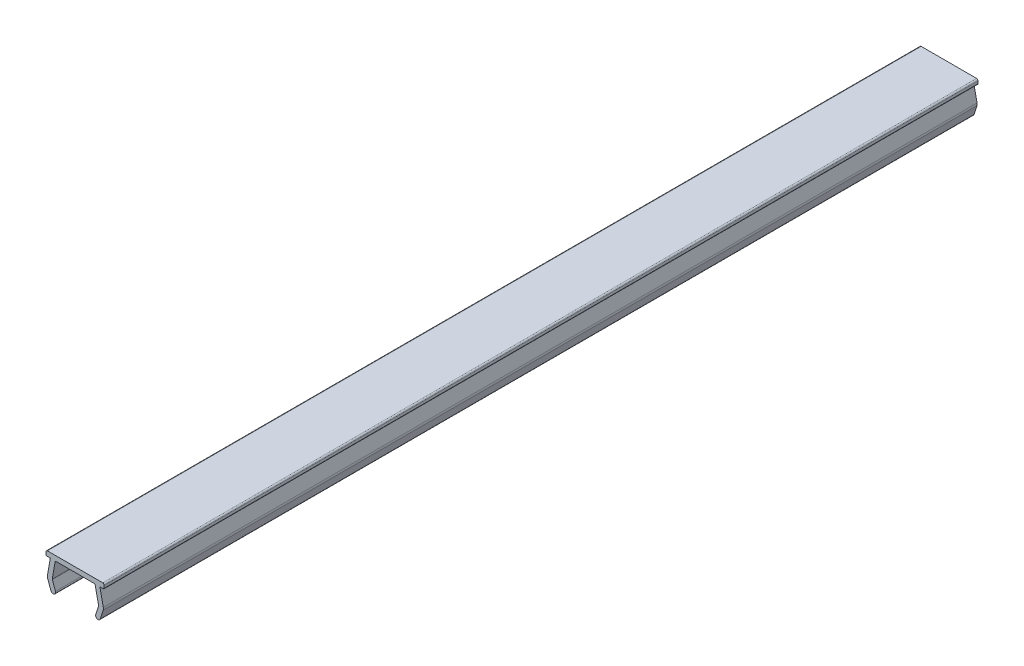
ISO-10303-21;
HEADER;
FILE_DESCRIPTION(('STEP AP214'),'2;1');
FILE_NAME('part.step','',(''),(''),'','','');
FILE_SCHEMA(('AUTOMOTIVE_DESIGN { 1 0 10303 214 1 1 1 1 }'));
ENDSEC;
DATA;
#1=APPLICATION_CONTEXT('core data for automotive mechanical design processes');
#2=APPLICATION_PROTOCOL_DEFINITION('international standard','automotive_design',2000,#1);
#3=PRODUCT_CONTEXT('',#1,'mechanical');
#4=PRODUCT('Part','Part','',(#3));
#5=PRODUCT_RELATED_PRODUCT_CATEGORY('part','',(#4));
#6=PRODUCT_DEFINITION_FORMATION('','',#4);
#7=PRODUCT_DEFINITION_CONTEXT('part definition',#1,'design');
#8=PRODUCT_DEFINITION('design','',#6,#7);
#9=PRODUCT_DEFINITION_SHAPE('','',#8);
#10=(LENGTH_UNIT() NAMED_UNIT(*) SI_UNIT(.MILLI.,.METRE.));
#11=(NAMED_UNIT(*) PLANE_ANGLE_UNIT() SI_UNIT($,.RADIAN.));
#12=(NAMED_UNIT(*) SI_UNIT($,.STERADIAN.) SOLID_ANGLE_UNIT());
#13=UNCERTAINTY_MEASURE_WITH_UNIT(LENGTH_MEASURE(1.E-05),#10,'distance_accuracy_value','');
#14=(GEOMETRIC_REPRESENTATION_CONTEXT(3) GLOBAL_UNCERTAINTY_ASSIGNED_CONTEXT((#13)) GLOBAL_UNIT_ASSIGNED_CONTEXT((#10,
#11,#12)) REPRESENTATION_CONTEXT('',''));
#15=CARTESIAN_POINT('',(0.,0.,0.));
#16=DIRECTION('',(0.,0.,1.));
#17=DIRECTION('',(1.,0.,0.));
#18=AXIS2_PLACEMENT_3D('',#15,#16,#17);
#19=CARTESIAN_POINT('',(10.8350640940869,93.7566345859164,180.));
#20=DIRECTION('',(0.,0.,-1.));
#21=DIRECTION('',(-1.,0.,0.));
#22=AXIS2_PLACEMENT_3D('',#19,#20,#21);
#23=CYLINDRICAL_SURFACE('',#22,0.999999999999551);
#24=CARTESIAN_POINT('',(10.8350640940869,93.7566345859164,0.));
#25=DIRECTION('',(0.,0.,1.));
#26=DIRECTION('',(1.,0.,0.));
#27=AXIS2_PLACEMENT_3D('',#24,#25,#26);
#28=CIRCLE('',#27,0.999999999999551);
#29=CARTESIAN_POINT('',(11.7860981628175,93.4475485135794,0.));
#30=VERTEX_POINT('',#29);
#31=CARTESIAN_POINT('',(11.8132267936406,93.964475229682,0.));
#32=VERTEX_POINT('',#31);
#33=EDGE_CURVE('E240',#30,#32,#28,.T.);
#34=ORIENTED_EDGE('',*,*,#33,.T.);
#35=DIRECTION('',(0.,0.,-1.));
#36=VECTOR('',#35,1.);
#37=CARTESIAN_POINT('',(11.8132267936406,93.964475229682,180.));
#38=LINE('',#37,#36);
#39=CARTESIAN_POINT('',(11.8132267936406,93.964475229682,180.));
#40=VERTEX_POINT('',#39);
#41=EDGE_CURVE('E11',#40,#32,#38,.T.);
#42=ORIENTED_EDGE('',*,*,#41,.F.);
#43=CARTESIAN_POINT('',(10.8350640940869,93.7566345859164,180.));
#44=DIRECTION('',(0.,0.,1.));
#45=DIRECTION('',(1.,0.,0.));
#46=AXIS2_PLACEMENT_3D('',#43,#44,#45);
#47=CIRCLE('',#46,0.999999999999551);
#48=CARTESIAN_POINT('',(11.7860981628175,93.4475485135794,180.));
#49=VERTEX_POINT('',#48);
#50=EDGE_CURVE('E290',#49,#40,#47,.T.);
#51=ORIENTED_EDGE('',*,*,#50,.F.);
#52=DIRECTION('',(0.,0.,-1.));
#53=VECTOR('',#52,1.);
#54=CARTESIAN_POINT('',(11.7860981628175,93.4475485135794,180.));
#55=LINE('',#54,#53);
#56=EDGE_CURVE('E236',#49,#30,#55,.T.);
#57=ORIENTED_EDGE('',*,*,#56,.T.);
#58=EDGE_LOOP('',(#34,#42,#51,#57));
#59=FACE_BOUND('',#58,.T.);
#60=ADVANCED_FACE('F36',(#59),#23,.T.);
#61=CARTESIAN_POINT('',(11.1069619444081,97.2883772298451,180.));
#62=DIRECTION('',(-0.978162699554305,-0.207840643764964,0.));
#63=DIRECTION('',(0.207840643764964,-0.978162699554305,0.));
#64=AXIS2_PLACEMENT_3D('',#61,#62,#63);
#65=PLANE('',#64);
#66=DIRECTION('',(-0.207840643764965,0.978162699554305,0.));
#67=VECTOR('',#66,1.);
#68=CARTESIAN_POINT('',(11.1069619444081,97.2883772298451,0.));
#69=LINE('',#68,#67);
#70=CARTESIAN_POINT('',(11.1069619444081,97.2883772298451,0.));
#71=VERTEX_POINT('',#70);
#72=EDGE_CURVE('E243',#32,#71,#69,.T.);
#73=ORIENTED_EDGE('',*,*,#72,.T.);
#74=DIRECTION('',(0.,0.,-1.));
#75=VECTOR('',#74,1.);
#76=CARTESIAN_POINT('',(11.1069619444081,97.2883772298451,180.));
#77=LINE('',#76,#75);
#78=CARTESIAN_POINT('',(11.1069619444081,97.2883772298451,180.));
#79=VERTEX_POINT('',#78);
#80=EDGE_CURVE('E44',#79,#71,#77,.T.);
#81=ORIENTED_EDGE('',*,*,#80,.F.);
#82=DIRECTION('',(-0.207840643764965,0.978162699554305,0.));
#83=VECTOR('',#82,1.);
#84=CARTESIAN_POINT('',(11.1069619444081,97.2883772298451,180.));
#85=LINE('',#84,#83);
#86=EDGE_CURVE('E149',#40,#79,#85,.T.);
#87=ORIENTED_EDGE('',*,*,#86,.F.);
#88=ORIENTED_EDGE('',*,*,#41,.T.);
#89=EDGE_LOOP('',(#73,#81,#87,#88));
#90=FACE_BOUND('',#89,.T.);
#91=ADVANCED_FACE('F438',(#90),#65,.F.);
#92=CARTESIAN_POINT('',(11.8000026893795,97.2883772298451,180.));
#93=DIRECTION('',(0.,1.,0.));
#94=DIRECTION('',(0.,0.,1.));
#95=AXIS2_PLACEMENT_3D('',#92,#93,#94);
#96=PLANE('',#95);
#97=DIRECTION('',(1.,0.,0.));
#98=VECTOR('',#97,1.);
#99=CARTESIAN_POINT('',(11.8000026893795,97.2883772298451,0.));
#100=LINE('',#99,#98);
#101=CARTESIAN_POINT('',(11.8000026893795,97.2883772298452,0.));
#102=VERTEX_POINT('',#101);
#103=EDGE_CURVE('E245',#71,#102,#100,.T.);
#104=ORIENTED_EDGE('',*,*,#103,.T.);
#105=DIRECTION('',(0.,0.,-1.));
#106=VECTOR('',#105,1.);
#107=CARTESIAN_POINT('',(11.8000026893795,97.2883772298452,180.));
#108=LINE('',#107,#106);
#109=CARTESIAN_POINT('',(11.8000026893795,97.2883772298452,180.));
#110=VERTEX_POINT('',#109);
#111=EDGE_CURVE('E351',#110,#102,#108,.T.);
#112=ORIENTED_EDGE('',*,*,#111,.F.);
#113=DIRECTION('',(1.,0.,0.));
#114=VECTOR('',#113,1.);
#115=CARTESIAN_POINT('',(11.8000026893795,97.2883772298451,180.));
#116=LINE('',#115,#114);
#117=EDGE_CURVE('E359',#79,#110,#116,.T.);
#118=ORIENTED_EDGE('',*,*,#117,.F.);
#119=ORIENTED_EDGE('',*,*,#80,.T.);
#120=EDGE_LOOP('',(#104,#112,#118,#119));
#121=FACE_BOUND('',#120,.T.);
#122=ADVANCED_FACE('F357',(#121),#96,.F.);
#123=CARTESIAN_POINT('',(11.8000026893795,97.4883772298454,180.));
#124=DIRECTION('',(0.,0.,-1.));
#125=DIRECTION('',(-1.,0.,0.));
#126=AXIS2_PLACEMENT_3D('',#123,#124,#125);
#127=CYLINDRICAL_SURFACE('',#126,0.200000000000197);
#128=CARTESIAN_POINT('',(11.8000026893795,97.4883772298454,0.));
#129=DIRECTION('',(0.,0.,1.));
#130=DIRECTION('',(1.,0.,0.));
#131=AXIS2_PLACEMENT_3D('',#128,#129,#130);
#132=CIRCLE('',#131,0.200000000000197);
#133=CARTESIAN_POINT('',(12.0000026893795,97.4883772298454,0.));
#134=VERTEX_POINT('',#133);
#135=EDGE_CURVE('E247',#102,#134,#132,.T.);
#136=ORIENTED_EDGE('',*,*,#135,.T.);
#137=DIRECTION('',(0.,0.,-1.));
#138=VECTOR('',#137,1.);
#139=CARTESIAN_POINT('',(12.0000026893795,97.4883772298454,180.));
#140=LINE('',#139,#138);
#141=CARTESIAN_POINT('',(12.0000026893795,97.4883772298454,180.));
#142=VERTEX_POINT('',#141);
#143=EDGE_CURVE('E348',#142,#134,#140,.T.);
#144=ORIENTED_EDGE('',*,*,#143,.F.);
#145=CARTESIAN_POINT('',(11.8000026893795,97.4883772298454,180.));
#146=DIRECTION('',(0.,0.,1.));
#147=DIRECTION('',(1.,0.,0.));
#148=AXIS2_PLACEMENT_3D('',#145,#146,#147);
#149=CIRCLE('',#148,0.200000000000197);
#150=EDGE_CURVE('E377',#110,#142,#149,.T.);
#151=ORIENTED_EDGE('',*,*,#150,.F.);
#152=ORIENTED_EDGE('',*,*,#111,.T.);
#153=EDGE_LOOP('',(#136,#144,#151,#152));
#154=FACE_BOUND('',#153,.T.);
#155=ADVANCED_FACE('F368',(#154),#127,.T.);
#156=CARTESIAN_POINT('',(12.0000026893795,97.9883772298435,180.));
#157=DIRECTION('',(-1.,0.,0.));
#158=DIRECTION('',(0.,0.,1.));
#159=AXIS2_PLACEMENT_3D('',#156,#157,#158);
#160=PLANE('',#159);
#161=DIRECTION('',(0.,1.,0.));
#162=VECTOR('',#161,1.);
#163=CARTESIAN_POINT('',(12.0000026893795,97.9883772298435,0.));
#164=LINE('',#163,#162);
#165=CARTESIAN_POINT('',(12.0000026893798,97.9883772298435,0.));
#166=VERTEX_POINT('',#165);
#167=EDGE_CURVE('E249',#134,#166,#164,.T.);
#168=ORIENTED_EDGE('',*,*,#167,.T.);
#169=DIRECTION('',(0.,0.,-1.));
#170=VECTOR('',#169,1.);
#171=CARTESIAN_POINT('',(12.0000026893798,97.9883772298435,180.));
#172=LINE('',#171,#170);
#173=CARTESIAN_POINT('',(12.0000026893798,97.9883772298435,180.));
#174=VERTEX_POINT('',#173);
#175=EDGE_CURVE('E345',#174,#166,#172,.T.);
#176=ORIENTED_EDGE('',*,*,#175,.F.);
#177=DIRECTION('',(0.,1.,0.));
#178=VECTOR('',#177,1.);
#179=CARTESIAN_POINT('',(12.0000026893795,97.9883772298435,180.));
#180=LINE('',#179,#178);
#181=EDGE_CURVE('E374',#142,#174,#180,.T.);
#182=ORIENTED_EDGE('',*,*,#181,.F.);
#183=ORIENTED_EDGE('',*,*,#143,.T.);
#184=EDGE_LOOP('',(#168,#176,#182,#183));
#185=FACE_BOUND('',#184,.T.);
#186=ADVANCED_FACE('F372',(#185),#160,.F.);
#187=CARTESIAN_POINT('',(11.7000026893802,97.9883772298435,180.));
#188=DIRECTION('',(0.,0.,-1.));
#189=DIRECTION('',(-1.,0.,0.));
#190=AXIS2_PLACEMENT_3D('',#187,#188,#189);
#191=CYLINDRICAL_SURFACE('',#190,0.299999999999631);
#192=CARTESIAN_POINT('',(11.7000026893802,97.9883772298435,0.));
#193=DIRECTION('',(0.,0.,1.));
#194=DIRECTION('',(1.,0.,0.));
#195=AXIS2_PLACEMENT_3D('',#192,#193,#194);
#196=CIRCLE('',#195,0.299999999999631);
#197=CARTESIAN_POINT('',(11.7000026893802,98.2883772298435,0.));
#198=VERTEX_POINT('',#197);
#199=EDGE_CURVE('E251',#166,#198,#196,.T.);
#200=ORIENTED_EDGE('',*,*,#199,.T.);
#201=DIRECTION('',(0.,0.,-1.));
#202=VECTOR('',#201,1.);
#203=CARTESIAN_POINT('',(11.7000026893802,98.2883772298435,180.));
#204=LINE('',#203,#202);
#205=CARTESIAN_POINT('',(11.7000026893802,98.2883772298435,180.));
#206=VERTEX_POINT('',#205);
#207=EDGE_CURVE('E342',#206,#198,#204,.T.);
#208=ORIENTED_EDGE('',*,*,#207,.F.);
#209=CARTESIAN_POINT('',(11.7000026893802,97.9883772298435,180.));
#210=DIRECTION('',(0.,0.,1.));
#211=DIRECTION('',(1.,0.,0.));
#212=AXIS2_PLACEMENT_3D('',#209,#210,#211);
#213=CIRCLE('',#212,0.299999999999631);
#214=EDGE_CURVE('E376',#174,#206,#213,.T.);
#215=ORIENTED_EDGE('',*,*,#214,.F.);
#216=ORIENTED_EDGE('',*,*,#175,.T.);
#217=EDGE_LOOP('',(#200,#208,#215,#216));
#218=FACE_BOUND('',#217,.T.);
#219=ADVANCED_FACE('F451',(#218),#191,.T.);
#220=CARTESIAN_POINT('',(0.300002689378744,98.2883772298428,180.));
#221=DIRECTION('',(0.,-1.,0.));
#222=DIRECTION('',(1.,0.,0.));
#223=AXIS2_PLACEMENT_3D('',#220,#221,#222);
#224=PLANE('',#223);
#225=DIRECTION('',(-1.,0.,0.));
#226=VECTOR('',#225,1.);
#227=CARTESIAN_POINT('',(0.300002689378744,98.2883772298428,0.));
#228=LINE('',#227,#226);
#229=CARTESIAN_POINT('',(0.300002689378744,98.2883772298432,0.));
#230=VERTEX_POINT('',#229);
#231=EDGE_CURVE('E253',#198,#230,#228,.T.);
#232=ORIENTED_EDGE('',*,*,#231,.T.);
#233=DIRECTION('',(0.,0.,-1.));
#234=VECTOR('',#233,1.);
#235=CARTESIAN_POINT('',(0.300002689378744,98.2883772298432,180.));
#236=LINE('',#235,#234);
#237=CARTESIAN_POINT('',(0.300002689378744,98.2883772298432,180.));
#238=VERTEX_POINT('',#237);
#239=EDGE_CURVE('E339',#238,#230,#236,.T.);
#240=ORIENTED_EDGE('',*,*,#239,.F.);
#241=DIRECTION('',(-1.,0.,0.));
#242=VECTOR('',#241,1.);
#243=CARTESIAN_POINT('',(0.300002689378744,98.2883772298428,180.));
#244=LINE('',#243,#242);
#245=EDGE_CURVE('E379',#206,#238,#244,.T.);
#246=ORIENTED_EDGE('',*,*,#245,.F.);
#247=ORIENTED_EDGE('',*,*,#207,.T.);
#248=EDGE_LOOP('',(#232,#240,#246,#247));
#249=FACE_BOUND('',#248,.T.);
#250=ADVANCED_FACE('F454',(#249),#224,.F.);
#251=CARTESIAN_POINT('',(0.300002689378744,97.9883772298435,180.));
#252=DIRECTION('',(0.,0.,-1.));
#253=DIRECTION('',(-1.,0.,0.));
#254=AXIS2_PLACEMENT_3D('',#251,#252,#253);
#255=CYLINDRICAL_SURFACE('',#254,0.299999999999643);
#256=CARTESIAN_POINT('',(0.300002689378744,97.9883772298435,0.));
#257=DIRECTION('',(0.,0.,1.));
#258=DIRECTION('',(1.,0.,0.));
#259=AXIS2_PLACEMENT_3D('',#256,#257,#258);
#260=CIRCLE('',#259,0.299999999999643);
#261=CARTESIAN_POINT('',(2.6893787435367E-06,97.9883772298435,0.));
#262=VERTEX_POINT('',#261);
#263=EDGE_CURVE('E255',#230,#262,#260,.T.);
#264=ORIENTED_EDGE('',*,*,#263,.T.);
#265=DIRECTION('',(0.,0.,-1.));
#266=VECTOR('',#265,1.);
#267=CARTESIAN_POINT('',(2.6893787435367E-06,97.9883772298435,180.));
#268=LINE('',#267,#266);
#269=CARTESIAN_POINT('',(2.6893787435367E-06,97.9883772298435,180.));
#270=VERTEX_POINT('',#269);
#271=EDGE_CURVE('E336',#270,#262,#268,.T.);
#272=ORIENTED_EDGE('',*,*,#271,.F.);
#273=CARTESIAN_POINT('',(0.300002689378744,97.9883772298435,180.));
#274=DIRECTION('',(0.,0.,1.));
#275=DIRECTION('',(1.,0.,0.));
#276=AXIS2_PLACEMENT_3D('',#273,#274,#275);
#277=CIRCLE('',#276,0.299999999999643);
#278=EDGE_CURVE('E385',#238,#270,#277,.T.);
#279=ORIENTED_EDGE('',*,*,#278,.F.);
#280=ORIENTED_EDGE('',*,*,#239,.T.);
#281=EDGE_LOOP('',(#264,#272,#279,#280));
#282=FACE_BOUND('',#281,.T.);
#283=ADVANCED_FACE('F458',(#282),#255,.T.);
#284=CARTESIAN_POINT('',(2.6893794711E-06,97.4883772298436,180.));
#285=DIRECTION('',(1.,1.45512660699133E-12,0.));
#286=DIRECTION('',(-1.45512660699133E-12,1.,0.));
#287=AXIS2_PLACEMENT_3D('',#284,#285,#286);
#288=PLANE('',#287);
#289=DIRECTION('',(1.45512660699133E-12,-1.,0.));
#290=VECTOR('',#289,1.);
#291=CARTESIAN_POINT('',(2.6893794711E-06,97.4883772298436,0.));
#292=LINE('',#291,#290);
#293=CARTESIAN_POINT('',(2.68937983897142E-06,97.4883772298436,0.));
#294=VERTEX_POINT('',#293);
#295=EDGE_CURVE('E257',#262,#294,#292,.T.);
#296=ORIENTED_EDGE('',*,*,#295,.T.);
#297=DIRECTION('',(0.,0.,-1.));
#298=VECTOR('',#297,1.);
#299=CARTESIAN_POINT('',(2.68937983897142E-06,97.4883772298436,180.));
#300=LINE('',#299,#298);
#301=CARTESIAN_POINT('',(2.68937983897142E-06,97.4883772298436,180.));
#302=VERTEX_POINT('',#301);
#303=EDGE_CURVE('E333',#302,#294,#300,.T.);
#304=ORIENTED_EDGE('',*,*,#303,.F.);
#305=DIRECTION('',(1.45512660699133E-12,-1.,0.));
#306=VECTOR('',#305,1.);
#307=CARTESIAN_POINT('',(2.6893794711E-06,97.4883772298436,180.));
#308=LINE('',#307,#306);
#309=EDGE_CURVE('E387',#270,#302,#308,.T.);
#310=ORIENTED_EDGE('',*,*,#309,.F.);
#311=ORIENTED_EDGE('',*,*,#271,.T.);
#312=EDGE_LOOP('',(#296,#304,#310,#311));
#313=FACE_BOUND('',#312,.T.);
#314=ADVANCED_FACE('F462',(#313),#288,.F.);
#315=CARTESIAN_POINT('',(0.200002689380199,97.4883772298436,180.));
#316=DIRECTION('',(0.,0.,-1.));
#317=DIRECTION('',(-1.,0.,0.));
#318=AXIS2_PLACEMENT_3D('',#315,#316,#317);
#319=CYLINDRICAL_SURFACE('',#318,0.20000000000036);
#320=CARTESIAN_POINT('',(0.200002689380199,97.4883772298436,0.));
#321=DIRECTION('',(0.,0.,1.));
#322=DIRECTION('',(1.,0.,0.));
#323=AXIS2_PLACEMENT_3D('',#320,#321,#322);
#324=CIRCLE('',#323,0.20000000000036);
#325=CARTESIAN_POINT('',(0.200002689380199,97.2883772298436,0.));
#326=VERTEX_POINT('',#325);
#327=EDGE_CURVE('E259',#294,#326,#324,.T.);
#328=ORIENTED_EDGE('',*,*,#327,.T.);
#329=DIRECTION('',(0.,0.,-1.));
#330=VECTOR('',#329,1.);
#331=CARTESIAN_POINT('',(0.200002689380199,97.2883772298436,180.));
#332=LINE('',#331,#330);
#333=CARTESIAN_POINT('',(0.200002689380199,97.2883772298436,180.));
#334=VERTEX_POINT('',#333);
#335=EDGE_CURVE('E330',#334,#326,#332,.T.);
#336=ORIENTED_EDGE('',*,*,#335,.F.);
#337=CARTESIAN_POINT('',(0.200002689380199,97.4883772298436,180.));
#338=DIRECTION('',(0.,0.,1.));
#339=DIRECTION('',(1.,0.,0.));
#340=AXIS2_PLACEMENT_3D('',#337,#338,#339);
#341=CIRCLE('',#340,0.20000000000036);
#342=EDGE_CURVE('E389',#302,#334,#341,.T.);
#343=ORIENTED_EDGE('',*,*,#342,.F.);
#344=ORIENTED_EDGE('',*,*,#303,.T.);
#345=EDGE_LOOP('',(#328,#336,#343,#344));
#346=FACE_BOUND('',#345,.T.);
#347=ADVANCED_FACE('F466',(#346),#319,.T.);
#348=CARTESIAN_POINT('',(0.893043433923595,97.2883772298428,180.));
#349=DIRECTION('',(1.10134697770573E-12,1.,0.));
#350=DIRECTION('',(-1.,1.10134697770573E-12,0.));
#351=AXIS2_PLACEMENT_3D('',#348,#349,#350);
#352=PLANE('',#351);
#353=DIRECTION('',(1.,-1.10134697770573E-12,0.));
#354=VECTOR('',#353,1.);
#355=CARTESIAN_POINT('',(0.893043433923595,97.2883772298428,0.));
#356=LINE('',#355,#354);
#357=CARTESIAN_POINT('',(0.893043433923595,97.2883772298428,0.));
#358=VERTEX_POINT('',#357);
#359=EDGE_CURVE('E261',#326,#358,#356,.T.);
#360=ORIENTED_EDGE('',*,*,#359,.T.);
#361=DIRECTION('',(0.,0.,-1.));
#362=VECTOR('',#361,1.);
#363=CARTESIAN_POINT('',(0.893043433923595,97.2883772298428,180.));
#364=LINE('',#363,#362);
#365=CARTESIAN_POINT('',(0.893043433923595,97.2883772298428,180.));
#366=VERTEX_POINT('',#365);
#367=EDGE_CURVE('E327',#366,#358,#364,.T.);
#368=ORIENTED_EDGE('',*,*,#367,.F.);
#369=DIRECTION('',(1.,-1.10134697770573E-12,0.));
#370=VECTOR('',#369,1.);
#371=CARTESIAN_POINT('',(0.893043433923595,97.2883772298428,180.));
#372=LINE('',#371,#370);
#373=EDGE_CURVE('E391',#334,#366,#372,.T.);
#374=ORIENTED_EDGE('',*,*,#373,.F.);
#375=ORIENTED_EDGE('',*,*,#335,.T.);
#376=EDGE_LOOP('',(#360,#368,#374,#375));
#377=FACE_BOUND('',#376,.T.);
#378=ADVANCED_FACE('F470',(#377),#352,.F.);
#379=CARTESIAN_POINT('',(0.294640490898019,93.8946654982574,180.));
#380=DIRECTION('',(0.984807753012197,-0.173648177666994,0.));
#381=DIRECTION('',(0.173648177666994,0.984807753012197,0.));
#382=AXIS2_PLACEMENT_3D('',#379,#380,#381);
#383=PLANE('',#382);
#384=DIRECTION('',(-0.173648177666994,-0.984807753012197,0.));
#385=VECTOR('',#384,1.);
#386=CARTESIAN_POINT('',(0.294640490898019,93.8946654982574,0.));
#387=LINE('',#386,#385);
#388=CARTESIAN_POINT('',(0.294640490897717,93.8946654982575,0.));
#389=VERTEX_POINT('',#388);
#390=EDGE_CURVE('E263',#358,#389,#387,.T.);
#391=ORIENTED_EDGE('',*,*,#390,.T.);
#392=DIRECTION('',(0.,0.,-1.));
#393=VECTOR('',#392,1.);
#394=CARTESIAN_POINT('',(0.294640490897717,93.8946654982575,180.));
#395=LINE('',#394,#393);
#396=CARTESIAN_POINT('',(0.294640490897717,93.8946654982575,180.));
#397=VERTEX_POINT('',#396);
#398=EDGE_CURVE('E324',#397,#389,#395,.T.);
#399=ORIENTED_EDGE('',*,*,#398,.F.);
#400=DIRECTION('',(-0.173648177666994,-0.984807753012197,0.));
#401=VECTOR('',#400,1.);
#402=CARTESIAN_POINT('',(0.294640490898019,93.8946654982574,180.));
#403=LINE('',#402,#401);
#404=EDGE_CURVE('E393',#366,#397,#403,.T.);
#405=ORIENTED_EDGE('',*,*,#404,.F.);
#406=ORIENTED_EDGE('',*,*,#367,.T.);
#407=EDGE_LOOP('',(#391,#399,#405,#406));
#408=FACE_BOUND('',#407,.T.);
#409=ADVANCED_FACE('F474',(#408),#383,.F.);
#410=CARTESIAN_POINT('',(1.27944824390943,93.7210173205895,180.));
#411=DIRECTION('',(0.,0.,-1.));
#412=DIRECTION('',(-1.,0.,0.));
#413=AXIS2_PLACEMENT_3D('',#410,#411,#412);
#414=CYLINDRICAL_SURFACE('',#413,0.999999999999695);
#415=CARTESIAN_POINT('',(1.27944824390943,93.7210173205895,0.));
#416=DIRECTION('',(0.,0.,1.));
#417=DIRECTION('',(1.,0.,0.));
#418=AXIS2_PLACEMENT_3D('',#415,#416,#417);
#419=CIRCLE('',#418,0.999999999999695);
#420=CARTESIAN_POINT('',(0.339755623123579,93.3789971772636,0.));
#421=VERTEX_POINT('',#420);
#422=EDGE_CURVE('E265',#389,#421,#419,.T.);
#423=ORIENTED_EDGE('',*,*,#422,.T.);
#424=DIRECTION('',(0.,0.,-1.));
#425=VECTOR('',#424,1.);
#426=CARTESIAN_POINT('',(0.339755623123579,93.3789971772636,180.));
#427=LINE('',#426,#425);
#428=CARTESIAN_POINT('',(0.339755623123579,93.3789971772636,180.));
#429=VERTEX_POINT('',#428);
#430=EDGE_CURVE('E321',#429,#421,#427,.T.);
#431=ORIENTED_EDGE('',*,*,#430,.F.);
#432=CARTESIAN_POINT('',(1.27944824390943,93.7210173205895,180.));
#433=DIRECTION('',(0.,0.,1.));
#434=DIRECTION('',(1.,0.,0.));
#435=AXIS2_PLACEMENT_3D('',#432,#433,#434);
#436=CIRCLE('',#435,0.999999999999695);
#437=EDGE_CURVE('E395',#397,#429,#436,.T.);
#438=ORIENTED_EDGE('',*,*,#437,.F.);
#439=ORIENTED_EDGE('',*,*,#398,.T.);
#440=EDGE_LOOP('',(#423,#431,#438,#439));
#441=FACE_BOUND('',#440,.T.);
#442=ADVANCED_FACE('F478',(#441),#414,.T.);
#443=CARTESIAN_POINT('',(1.00759198215019,91.5441318609537,180.));
#444=DIRECTION('',(0.93969262078552,0.342020143326736,0.));
#445=DIRECTION('',(-0.342020143326736,0.93969262078552,0.));
#446=AXIS2_PLACEMENT_3D('',#443,#444,#445);
#447=PLANE('',#446);
#448=DIRECTION('',(0.342020143326736,-0.93969262078552,0.));
#449=VECTOR('',#448,1.);
#450=CARTESIAN_POINT('',(1.00759198215019,91.5441318609537,0.));
#451=LINE('',#450,#449);
#452=CARTESIAN_POINT('',(1.00759198214989,91.5441318609536,0.));
#453=VERTEX_POINT('',#452);
#454=EDGE_CURVE('E267',#421,#453,#451,.T.);
#455=ORIENTED_EDGE('',*,*,#454,.T.);
#456=DIRECTION('',(0.,0.,-1.));
#457=VECTOR('',#456,1.);
#458=CARTESIAN_POINT('',(1.00759198214989,91.5441318609536,180.));
#459=LINE('',#458,#457);
#460=CARTESIAN_POINT('',(1.00759198214989,91.5441318609536,180.));
#461=VERTEX_POINT('',#460);
#462=EDGE_CURVE('E318',#461,#453,#459,.T.);
#463=ORIENTED_EDGE('',*,*,#462,.F.);
#464=DIRECTION('',(0.342020143326736,-0.93969262078552,0.));
#465=VECTOR('',#464,1.);
#466=CARTESIAN_POINT('',(1.00759198215019,91.5441318609537,180.));
#467=LINE('',#466,#465);
#468=EDGE_CURVE('E397',#429,#461,#467,.T.);
#469=ORIENTED_EDGE('',*,*,#468,.F.);
#470=ORIENTED_EDGE('',*,*,#430,.T.);
#471=EDGE_LOOP('',(#455,#463,#469,#470));
#472=FACE_BOUND('',#471,.T.);
#473=ADVANCED_FACE('F482',(#472),#447,.F.);
#474=CARTESIAN_POINT('',(1.4774382925425,91.7151419326165,180.));
#475=DIRECTION('',(0.,0.,-1.));
#476=DIRECTION('',(-1.,0.,0.));
#477=AXIS2_PLACEMENT_3D('',#474,#475,#476);
#478=CYLINDRICAL_SURFACE('',#477,0.499999999999685);
#479=CARTESIAN_POINT('',(1.4774382925425,91.7151419326165,0.));
#480=DIRECTION('',(0.,0.,1.));
#481=DIRECTION('',(1.,0.,0.));
#482=AXIS2_PLACEMENT_3D('',#479,#480,#481);
#483=CIRCLE('',#482,0.499999999999685);
#484=CARTESIAN_POINT('',(1.94728460293543,91.8861520042794,0.));
#485=VERTEX_POINT('',#484);
#486=EDGE_CURVE('E269',#453,#485,#483,.T.);
#487=ORIENTED_EDGE('',*,*,#486,.T.);
#488=DIRECTION('',(0.,0.,-1.));
#489=VECTOR('',#488,1.);
#490=CARTESIAN_POINT('',(1.94728460293543,91.8861520042794,180.));
#491=LINE('',#490,#489);
#492=CARTESIAN_POINT('',(1.94728460293543,91.8861520042794,180.));
#493=VERTEX_POINT('',#492);
#494=EDGE_CURVE('E315',#493,#485,#491,.T.);
#495=ORIENTED_EDGE('',*,*,#494,.F.);
#496=CARTESIAN_POINT('',(1.4774382925425,91.7151419326165,180.));
#497=DIRECTION('',(0.,0.,1.));
#498=DIRECTION('',(1.,0.,0.));
#499=AXIS2_PLACEMENT_3D('',#496,#497,#498);
#500=CIRCLE('',#499,0.499999999999685);
#501=EDGE_CURVE('E399',#461,#493,#500,.T.);
#502=ORIENTED_EDGE('',*,*,#501,.F.);
#503=ORIENTED_EDGE('',*,*,#462,.T.);
#504=EDGE_LOOP('',(#487,#495,#502,#503));
#505=FACE_BOUND('',#504,.T.);
#506=ADVANCED_FACE('F486',(#505),#478,.T.);
#507=CARTESIAN_POINT('',(1.30235924920998,93.6580698508715,180.));
#508=DIRECTION('',(-0.939692620785763,-0.342020143326069,0.));
#509=DIRECTION('',(0.342020143326069,-0.939692620785763,0.));
#510=AXIS2_PLACEMENT_3D('',#507,#508,#509);
#511=PLANE('',#510);
#512=DIRECTION('',(-0.342020143326069,0.939692620785763,0.));
#513=VECTOR('',#512,1.);
#514=CARTESIAN_POINT('',(1.30235924920998,93.6580698508715,0.));
#515=LINE('',#514,#513);
#516=CARTESIAN_POINT('',(1.30235924920984,93.6580698508714,0.));
#517=VERTEX_POINT('',#516);
#518=EDGE_CURVE('E271',#485,#517,#515,.T.);
#519=ORIENTED_EDGE('',*,*,#518,.T.);
#520=DIRECTION('',(0.,0.,-1.));
#521=VECTOR('',#520,1.);
#522=CARTESIAN_POINT('',(1.30235924920984,93.6580698508714,180.));
#523=LINE('',#522,#521);
#524=CARTESIAN_POINT('',(1.30235924920984,93.6580698508714,180.));
#525=VERTEX_POINT('',#524);
#526=EDGE_CURVE('E312',#525,#517,#523,.T.);
#527=ORIENTED_EDGE('',*,*,#526,.F.);
#528=DIRECTION('',(-0.342020143326069,0.939692620785763,0.));
#529=VECTOR('',#528,1.);
#530=CARTESIAN_POINT('',(1.30235924920998,93.6580698508715,180.));
#531=LINE('',#530,#529);
#532=EDGE_CURVE('E401',#493,#525,#531,.T.);
#533=ORIENTED_EDGE('',*,*,#532,.F.);
#534=ORIENTED_EDGE('',*,*,#494,.T.);
#535=EDGE_LOOP('',(#519,#527,#533,#534));
#536=FACE_BOUND('',#535,.T.);
#537=ADVANCED_FACE('F490',(#536),#511,.F.);
#538=CARTESIAN_POINT('',(1.53728240440614,93.7435748867028,180.));
#539=DIRECTION('',(0.,0.,-1.));
#540=DIRECTION('',(-1.,0.,0.));
#541=AXIS2_PLACEMENT_3D('',#538,#539,#540);
#542=CYLINDRICAL_SURFACE('',#541,0.249999999999842);
#543=CARTESIAN_POINT('',(1.53728240440614,93.7435748867028,0.));
#544=DIRECTION('',(0.,0.,-1.));
#545=DIRECTION('',(1.,0.,0.));
#546=AXIS2_PLACEMENT_3D('',#543,#544,#545);
#547=CIRCLE('',#546,0.249999999999842);
#548=CARTESIAN_POINT('',(1.2910804661531,93.7869869311197,0.));
#549=VERTEX_POINT('',#548);
#550=EDGE_CURVE('E273',#517,#549,#547,.T.);
#551=ORIENTED_EDGE('',*,*,#550,.T.);
#552=DIRECTION('',(0.,0.,-1.));
#553=VECTOR('',#552,1.);
#554=CARTESIAN_POINT('',(1.2910804661531,93.7869869311197,180.));
#555=LINE('',#554,#553);
#556=CARTESIAN_POINT('',(1.2910804661531,93.7869869311197,180.));
#557=VERTEX_POINT('',#556);
#558=EDGE_CURVE('E309',#557,#549,#555,.T.);
#559=ORIENTED_EDGE('',*,*,#558,.F.);
#560=CARTESIAN_POINT('',(1.53728240440614,93.7435748867028,180.));
#561=DIRECTION('',(0.,0.,-1.));
#562=DIRECTION('',(1.,0.,0.));
#563=AXIS2_PLACEMENT_3D('',#560,#561,#562);
#564=CIRCLE('',#563,0.249999999999842);
#565=EDGE_CURVE('E403',#525,#557,#564,.T.);
#566=ORIENTED_EDGE('',*,*,#565,.F.);
#567=ORIENTED_EDGE('',*,*,#526,.T.);
#568=EDGE_LOOP('',(#551,#559,#566,#567));
#569=FACE_BOUND('',#568,.T.);
#570=ADVANCED_FACE('F494',(#569),#542,.F.);
#571=CARTESIAN_POINT('',(1.87932842144104,97.1231068653778,180.));
#572=DIRECTION('',(-0.984807753012265,0.173648177666609,0.));
#573=DIRECTION('',(-0.173648177666609,-0.984807753012265,0.));
#574=AXIS2_PLACEMENT_3D('',#571,#572,#573);
#575=PLANE('',#574);
#576=DIRECTION('',(0.173648177666609,0.984807753012265,0.));
#577=VECTOR('',#576,1.);
#578=CARTESIAN_POINT('',(1.87932842144104,97.1231068653778,0.));
#579=LINE('',#578,#577);
#580=CARTESIAN_POINT('',(1.87932842144175,97.1231068653777,0.));
#581=VERTEX_POINT('',#580);
#582=EDGE_CURVE('E275',#549,#581,#579,.T.);
#583=ORIENTED_EDGE('',*,*,#582,.T.);
#584=DIRECTION('',(0.,0.,-1.));
#585=VECTOR('',#584,1.);
#586=CARTESIAN_POINT('',(1.87932842144175,97.1231068653777,180.));
#587=LINE('',#586,#585);
#588=CARTESIAN_POINT('',(1.87932842144175,97.1231068653777,180.));
#589=VERTEX_POINT('',#588);
#590=EDGE_CURVE('E306',#589,#581,#587,.T.);
#591=ORIENTED_EDGE('',*,*,#590,.F.);
#592=DIRECTION('',(0.173648177666609,0.984807753012265,0.));
#593=VECTOR('',#592,1.);
#594=CARTESIAN_POINT('',(1.87932842144104,97.1231068653778,180.));
#595=LINE('',#594,#593);
#596=EDGE_CURVE('E405',#557,#589,#595,.T.);
#597=ORIENTED_EDGE('',*,*,#596,.F.);
#598=ORIENTED_EDGE('',*,*,#558,.T.);
#599=EDGE_LOOP('',(#583,#591,#597,#598));
#600=FACE_BOUND('',#599,.T.);
#601=ADVANCED_FACE('F498',(#600),#575,.F.);
#602=CARTESIAN_POINT('',(2.07628997204665,97.0883772298439,180.));
#603=DIRECTION('',(0.,0.,-1.));
#604=DIRECTION('',(-1.,0.,0.));
#605=AXIS2_PLACEMENT_3D('',#602,#603,#604);
#606=CYLINDRICAL_SURFACE('',#605,0.200000000002481);
#607=CARTESIAN_POINT('',(2.07628997204665,97.0883772298439,0.));
#608=DIRECTION('',(0.,0.,-1.));
#609=DIRECTION('',(1.,0.,0.));
#610=AXIS2_PLACEMENT_3D('',#607,#608,#609);
#611=CIRCLE('',#610,0.200000000002481);
#612=CARTESIAN_POINT('',(2.07628997204665,97.2883772298457,0.));
#613=VERTEX_POINT('',#612);
#614=EDGE_CURVE('E277',#581,#613,#611,.T.);
#615=ORIENTED_EDGE('',*,*,#614,.T.);
#616=DIRECTION('',(0.,0.,-1.));
#617=VECTOR('',#616,1.);
#618=CARTESIAN_POINT('',(2.07628997204665,97.2883772298457,180.));
#619=LINE('',#618,#617);
#620=CARTESIAN_POINT('',(2.07628997204665,97.2883772298457,180.));
#621=VERTEX_POINT('',#620);
#622=EDGE_CURVE('E303',#621,#613,#619,.T.);
#623=ORIENTED_EDGE('',*,*,#622,.F.);
#624=CARTESIAN_POINT('',(2.07628997204665,97.0883772298439,180.));
#625=DIRECTION('',(0.,0.,-1.));
#626=DIRECTION('',(1.,0.,0.));
#627=AXIS2_PLACEMENT_3D('',#624,#625,#626);
#628=CIRCLE('',#627,0.200000000002481);
#629=EDGE_CURVE('E407',#589,#621,#628,.T.);
#630=ORIENTED_EDGE('',*,*,#629,.F.);
#631=ORIENTED_EDGE('',*,*,#590,.T.);
#632=EDGE_LOOP('',(#615,#623,#630,#631));
#633=FACE_BOUND('',#632,.T.);
#634=ADVANCED_FACE('F502',(#633),#606,.F.);
#635=CARTESIAN_POINT('',(9.92729274989324,97.2883772298457,180.));
#636=DIRECTION('',(0.,1.,0.));
#637=DIRECTION('',(0.,0.,1.));
#638=AXIS2_PLACEMENT_3D('',#635,#636,#637);
#639=PLANE('',#638);
#640=DIRECTION('',(1.,0.,0.));
#641=VECTOR('',#640,1.);
#642=CARTESIAN_POINT('',(9.92729274989324,97.2883772298457,0.));
#643=LINE('',#642,#641);
#644=CARTESIAN_POINT('',(9.92729274989324,97.2883772298457,0.));
#645=VERTEX_POINT('',#644);
#646=EDGE_CURVE('E279',#613,#645,#643,.T.);
#647=ORIENTED_EDGE('',*,*,#646,.T.);
#648=DIRECTION('',(0.,0.,-1.));
#649=VECTOR('',#648,1.);
#650=CARTESIAN_POINT('',(9.92729274989324,97.2883772298457,180.));
#651=LINE('',#650,#649);
#652=CARTESIAN_POINT('',(9.92729274989324,97.2883772298457,180.));
#653=VERTEX_POINT('',#652);
#654=EDGE_CURVE('E300',#653,#645,#651,.T.);
#655=ORIENTED_EDGE('',*,*,#654,.F.);
#656=DIRECTION('',(1.,0.,0.));
#657=VECTOR('',#656,1.);
#658=CARTESIAN_POINT('',(9.92729274989324,97.2883772298457,180.));
#659=LINE('',#658,#657);
#660=EDGE_CURVE('E409',#621,#653,#659,.T.);
#661=ORIENTED_EDGE('',*,*,#660,.F.);
#662=ORIENTED_EDGE('',*,*,#622,.T.);
#663=EDGE_LOOP('',(#647,#655,#661,#662));
#664=FACE_BOUND('',#663,.T.);
#665=ADVANCED_FACE('F506',(#664),#639,.F.);
#666=CARTESIAN_POINT('',(9.92729274989324,97.0883772298462,180.));
#667=DIRECTION('',(0.,0.,-1.));
#668=DIRECTION('',(-1.,0.,0.));
#669=AXIS2_PLACEMENT_3D('',#666,#667,#668);
#670=CYLINDRICAL_SURFACE('',#669,0.199999999999439);
#671=CARTESIAN_POINT('',(9.92729274989324,97.0883772298462,0.));
#672=DIRECTION('',(0.,0.,-1.));
#673=DIRECTION('',(1.,0.,0.));
#674=AXIS2_PLACEMENT_3D('',#671,#672,#673);
#675=CIRCLE('',#674,0.199999999999439);
#676=CARTESIAN_POINT('',(10.1229252898035,97.1299453585992,0.));
#677=VERTEX_POINT('',#676);
#678=EDGE_CURVE('E281',#645,#677,#675,.T.);
#679=ORIENTED_EDGE('',*,*,#678,.T.);
#680=DIRECTION('',(0.,0.,-1.));
#681=VECTOR('',#680,1.);
#682=CARTESIAN_POINT('',(10.1229252898035,97.1299453585992,180.));
#683=LINE('',#682,#681);
#684=CARTESIAN_POINT('',(10.1229252898035,97.1299453585992,180.));
#685=VERTEX_POINT('',#684);
#686=EDGE_CURVE('E297',#685,#677,#683,.T.);
#687=ORIENTED_EDGE('',*,*,#686,.F.);
#688=CARTESIAN_POINT('',(9.92729274989324,97.0883772298462,180.));
#689=DIRECTION('',(0.,0.,-1.));
#690=DIRECTION('',(1.,0.,0.));
#691=AXIS2_PLACEMENT_3D('',#688,#689,#690);
#692=CIRCLE('',#691,0.199999999999439);
#693=EDGE_CURVE('E411',#653,#685,#692,.T.);
#694=ORIENTED_EDGE('',*,*,#693,.F.);
#695=ORIENTED_EDGE('',*,*,#654,.T.);
#696=EDGE_LOOP('',(#679,#687,#694,#695));
#697=FACE_BOUND('',#696,.T.);
#698=ADVANCED_FACE('F510',(#697),#670,.F.);
#699=CARTESIAN_POINT('',(10.8239376924424,93.8307630054027,180.));
#700=DIRECTION('',(0.978162699554308,0.207840643764951,0.));
#701=DIRECTION('',(-0.207840643764951,0.978162699554308,0.));
#702=AXIS2_PLACEMENT_3D('',#699,#700,#701);
#703=PLANE('',#702);
#704=DIRECTION('',(0.207840643764951,-0.978162699554308,0.));
#705=VECTOR('',#704,1.);
#706=CARTESIAN_POINT('',(10.8239376924424,93.8307630054027,0.));
#707=LINE('',#706,#705);
#708=CARTESIAN_POINT('',(10.8239376924424,93.8307630054027,0.));
#709=VERTEX_POINT('',#708);
#710=EDGE_CURVE('E283',#677,#709,#707,.T.);
#711=ORIENTED_EDGE('',*,*,#710,.T.);
#712=DIRECTION('',(0.,0.,-1.));
#713=VECTOR('',#712,1.);
#714=CARTESIAN_POINT('',(10.8239376924424,93.8307630054027,180.));
#715=LINE('',#714,#713);
#716=CARTESIAN_POINT('',(10.8239376924424,93.8307630054027,180.));
#717=VERTEX_POINT('',#716);
#718=EDGE_CURVE('E294',#717,#709,#715,.T.);
#719=ORIENTED_EDGE('',*,*,#718,.F.);
#720=DIRECTION('',(0.207840643764951,-0.978162699554308,0.));
#721=VECTOR('',#720,1.);
#722=CARTESIAN_POINT('',(10.8239376924424,93.8307630054027,180.));
#723=LINE('',#722,#721);
#724=EDGE_CURVE('E413',#685,#717,#723,.T.);
#725=ORIENTED_EDGE('',*,*,#724,.F.);
#726=ORIENTED_EDGE('',*,*,#686,.T.);
#727=EDGE_LOOP('',(#711,#719,#725,#726));
#728=FACE_BOUND('',#727,.T.);
#729=ADVANCED_FACE('F419',(#728),#703,.F.);
#730=CARTESIAN_POINT('',(10.579397017554,93.7788028444615,180.));
#731=DIRECTION('',(0.,0.,-1.));
#732=DIRECTION('',(-1.,0.,0.));
#733=AXIS2_PLACEMENT_3D('',#730,#731,#732);
#734=CYLINDRICAL_SURFACE('',#733,0.249999999999919);
#735=CARTESIAN_POINT('',(10.579397017554,93.7788028444615,0.));
#736=DIRECTION('',(0.,0.,-1.));
#737=DIRECTION('',(1.,0.,0.));
#738=AXIS2_PLACEMENT_3D('',#735,#736,#737);
#739=CIRCLE('',#738,0.249999999999919);
#740=CARTESIAN_POINT('',(10.8171555347366,93.7015313263769,0.));
#741=VERTEX_POINT('',#740);
#742=EDGE_CURVE('E285',#709,#741,#739,.T.);
#743=ORIENTED_EDGE('',*,*,#742,.T.);
#744=DIRECTION('',(0.,0.,-1.));
#745=VECTOR('',#744,1.);
#746=CARTESIAN_POINT('',(10.8171555347366,93.7015313263769,180.));
#747=LINE('',#746,#745);
#748=CARTESIAN_POINT('',(10.8171555347366,93.7015313263769,180.));
#749=VERTEX_POINT('',#748);
#750=EDGE_CURVE('E231',#749,#741,#747,.T.);
#751=ORIENTED_EDGE('',*,*,#750,.F.);
#752=CARTESIAN_POINT('',(10.579397017554,93.7788028444615,180.));
#753=DIRECTION('',(0.,0.,-1.));
#754=DIRECTION('',(1.,0.,0.));
#755=AXIS2_PLACEMENT_3D('',#752,#753,#754);
#756=CIRCLE('',#755,0.249999999999919);
#757=EDGE_CURVE('E222',#717,#749,#756,.T.);
#758=ORIENTED_EDGE('',*,*,#757,.F.);
#759=ORIENTED_EDGE('',*,*,#718,.T.);
#760=EDGE_LOOP('',(#743,#751,#758,#759));
#761=FACE_BOUND('',#760,.T.);
#762=ADVANCED_FACE('F423',(#761),#734,.F.);
#763=CARTESIAN_POINT('',(10.2343318372943,91.9082276419307,180.));
#764=DIRECTION('',(0.951034068731381,-0.309086072336227,0.));
#765=DIRECTION('',(0.309086072336227,0.951034068731381,0.));
#766=AXIS2_PLACEMENT_3D('',#763,#764,#765);
#767=PLANE('',#766);
#768=DIRECTION('',(-0.309086072336226,-0.951034068731381,0.));
#769=VECTOR('',#768,1.);
#770=CARTESIAN_POINT('',(10.2343318372943,91.9082276419307,0.));
#771=LINE('',#770,#769);
#772=CARTESIAN_POINT('',(10.2343318372943,91.9082276419307,0.));
#773=VERTEX_POINT('',#772);
#774=EDGE_CURVE('E230',#741,#773,#771,.T.);
#775=ORIENTED_EDGE('',*,*,#774,.T.);
#776=DIRECTION('',(0.,0.,-1.));
#777=VECTOR('',#776,1.);
#778=CARTESIAN_POINT('',(10.2343318372943,91.9082276419307,180.));
#779=LINE('',#778,#777);
#780=CARTESIAN_POINT('',(10.2343318372943,91.9082276419307,180.));
#781=VERTEX_POINT('',#780);
#782=EDGE_CURVE('E227',#781,#773,#779,.T.);
#783=ORIENTED_EDGE('',*,*,#782,.F.);
#784=DIRECTION('',(-0.309086072336226,-0.951034068731381,0.));
#785=VECTOR('',#784,1.);
#786=CARTESIAN_POINT('',(10.2343318372943,91.9082276419307,180.));
#787=LINE('',#786,#785);
#788=EDGE_CURVE('E216',#749,#781,#787,.T.);
#789=ORIENTED_EDGE('',*,*,#788,.F.);
#790=ORIENTED_EDGE('',*,*,#750,.T.);
#791=EDGE_LOOP('',(#775,#783,#789,#790));
#792=FACE_BOUND('',#791,.T.);
#793=ADVANCED_FACE('F228',(#792),#767,.F.);
#794=CARTESIAN_POINT('',(10.7098488716595,91.7536846057626,180.));
#795=DIRECTION('',(0.,0.,-1.));
#796=DIRECTION('',(-1.,0.,0.));
#797=AXIS2_PLACEMENT_3D('',#794,#795,#796);
#798=CYLINDRICAL_SURFACE('',#797,0.499999999999545);
#799=CARTESIAN_POINT('',(10.7098488716595,91.7536846057626,0.));
#800=DIRECTION('',(0.,0.,1.));
#801=DIRECTION('',(1.,0.,0.));
#802=AXIS2_PLACEMENT_3D('',#799,#800,#801);
#803=CIRCLE('',#802,0.499999999999545);
#804=CARTESIAN_POINT('',(11.1853659060246,91.5991415695939,0.));
#805=VERTEX_POINT('',#804);
#806=EDGE_CURVE('E135',#773,#805,#803,.T.);
#807=ORIENTED_EDGE('',*,*,#806,.T.);
#808=DIRECTION('',(0.,0.,-1.));
#809=VECTOR('',#808,1.);
#810=CARTESIAN_POINT('',(11.1853659060246,91.5991415695939,180.));
#811=LINE('',#810,#809);
#812=CARTESIAN_POINT('',(11.1853659060246,91.5991415695939,180.));
#813=VERTEX_POINT('',#812);
#814=EDGE_CURVE('E232',#813,#805,#811,.T.);
#815=ORIENTED_EDGE('',*,*,#814,.F.);
#816=CARTESIAN_POINT('',(10.7098488716595,91.7536846057626,180.));
#817=DIRECTION('',(0.,0.,1.));
#818=DIRECTION('',(1.,0.,0.));
#819=AXIS2_PLACEMENT_3D('',#816,#817,#818);
#820=CIRCLE('',#819,0.499999999999545);
#821=EDGE_CURVE('E220',#781,#813,#820,.T.);
#822=ORIENTED_EDGE('',*,*,#821,.F.);
#823=ORIENTED_EDGE('',*,*,#782,.T.);
#824=EDGE_LOOP('',(#807,#815,#822,#823));
#825=FACE_BOUND('',#824,.T.);
#826=ADVANCED_FACE('F234',(#825),#798,.T.);
#827=CARTESIAN_POINT('',(11.7860981628175,93.4475485135794,180.));
#828=DIRECTION('',(-0.951034068731298,0.309086072336481,0.));
#829=DIRECTION('',(-0.309086072336481,-0.951034068731298,0.));
#830=AXIS2_PLACEMENT_3D('',#827,#828,#829);
#831=PLANE('',#830);
#832=DIRECTION('',(0.309086072336481,0.951034068731298,0.));
#833=VECTOR('',#832,1.);
#834=CARTESIAN_POINT('',(11.7860981628175,93.4475485135794,0.));
#835=LINE('',#834,#833);
#836=EDGE_CURVE('E141',#805,#30,#835,.T.);
#837=ORIENTED_EDGE('',*,*,#836,.T.);
#838=ORIENTED_EDGE('',*,*,#56,.F.);
#839=DIRECTION('',(0.309086072336481,0.951034068731298,0.));
#840=VECTOR('',#839,1.);
#841=CARTESIAN_POINT('',(11.7860981628175,93.4475485135794,180.));
#842=LINE('',#841,#840);
#843=EDGE_CURVE('E52',#813,#49,#842,.T.);
#844=ORIENTED_EDGE('',*,*,#843,.F.);
#845=ORIENTED_EDGE('',*,*,#814,.T.);
#846=EDGE_LOOP('',(#837,#838,#844,#845));
#847=FACE_BOUND('',#846,.T.);
#848=ADVANCED_FACE('F427',(#847),#831,.F.);
#849=CARTESIAN_POINT('',(10.8350640940869,93.7566345859164,180.));
#850=DIRECTION('',(0.,0.,1.));
#851=DIRECTION('',(1.,0.,0.));
#852=AXIS2_PLACEMENT_3D('',#849,#850,#851);
#853=PLANE('',#852);
#854=ORIENTED_EDGE('',*,*,#50,.T.);
#855=ORIENTED_EDGE('',*,*,#86,.T.);
#856=ORIENTED_EDGE('',*,*,#117,.T.);
#857=ORIENTED_EDGE('',*,*,#150,.T.);
#858=ORIENTED_EDGE('',*,*,#181,.T.);
#859=ORIENTED_EDGE('',*,*,#214,.T.);
#860=ORIENTED_EDGE('',*,*,#245,.T.);
#861=ORIENTED_EDGE('',*,*,#278,.T.);
#862=ORIENTED_EDGE('',*,*,#309,.T.);
#863=ORIENTED_EDGE('',*,*,#342,.T.);
#864=ORIENTED_EDGE('',*,*,#373,.T.);
#865=ORIENTED_EDGE('',*,*,#404,.T.);
#866=ORIENTED_EDGE('',*,*,#437,.T.);
#867=ORIENTED_EDGE('',*,*,#468,.T.);
#868=ORIENTED_EDGE('',*,*,#501,.T.);
#869=ORIENTED_EDGE('',*,*,#532,.T.);
#870=ORIENTED_EDGE('',*,*,#565,.T.);
#871=ORIENTED_EDGE('',*,*,#596,.T.);
#872=ORIENTED_EDGE('',*,*,#629,.T.);
#873=ORIENTED_EDGE('',*,*,#660,.T.);
#874=ORIENTED_EDGE('',*,*,#693,.T.);
#875=ORIENTED_EDGE('',*,*,#724,.T.);
#876=ORIENTED_EDGE('',*,*,#757,.T.);
#877=ORIENTED_EDGE('',*,*,#788,.T.);
#878=ORIENTED_EDGE('',*,*,#821,.T.);
#879=ORIENTED_EDGE('',*,*,#843,.T.);
#880=EDGE_LOOP('',(#854,#855,#856,#857,#858,#859,#860,#861,#862,#863,#864,#865,#866,#867,#868,
#869,#870,#871,#872,#873,#874,#875,#876,#877,#878,#879));
#881=FACE_BOUND('',#880,.T.);
#882=ADVANCED_FACE('F218',(#881),#853,.T.);
#883=CARTESIAN_POINT('',(10.8350640940869,93.7566345859164,0.));
#884=DIRECTION('',(0.,0.,1.));
#885=DIRECTION('',(1.,0.,0.));
#886=AXIS2_PLACEMENT_3D('',#883,#884,#885);
#887=PLANE('',#886);
#888=ORIENTED_EDGE('',*,*,#33,.F.);
#889=ORIENTED_EDGE('',*,*,#836,.F.);
#890=ORIENTED_EDGE('',*,*,#806,.F.);
#891=ORIENTED_EDGE('',*,*,#774,.F.);
#892=ORIENTED_EDGE('',*,*,#742,.F.);
#893=ORIENTED_EDGE('',*,*,#710,.F.);
#894=ORIENTED_EDGE('',*,*,#678,.F.);
#895=ORIENTED_EDGE('',*,*,#646,.F.);
#896=ORIENTED_EDGE('',*,*,#614,.F.);
#897=ORIENTED_EDGE('',*,*,#582,.F.);
#898=ORIENTED_EDGE('',*,*,#550,.F.);
#899=ORIENTED_EDGE('',*,*,#518,.F.);
#900=ORIENTED_EDGE('',*,*,#486,.F.);
#901=ORIENTED_EDGE('',*,*,#454,.F.);
#902=ORIENTED_EDGE('',*,*,#422,.F.);
#903=ORIENTED_EDGE('',*,*,#390,.F.);
#904=ORIENTED_EDGE('',*,*,#359,.F.);
#905=ORIENTED_EDGE('',*,*,#327,.F.);
#906=ORIENTED_EDGE('',*,*,#295,.F.);
#907=ORIENTED_EDGE('',*,*,#263,.F.);
#908=ORIENTED_EDGE('',*,*,#231,.F.);
#909=ORIENTED_EDGE('',*,*,#199,.F.);
#910=ORIENTED_EDGE('',*,*,#167,.F.);
#911=ORIENTED_EDGE('',*,*,#135,.F.);
#912=ORIENTED_EDGE('',*,*,#103,.F.);
#913=ORIENTED_EDGE('',*,*,#72,.F.);
#914=EDGE_LOOP('',(#888,#889,#890,#891,#892,#893,#894,#895,#896,#897,#898,#899,#900,#901,#902,
#903,#904,#905,#906,#907,#908,#909,#910,#911,#912,#913));
#915=FACE_BOUND('',#914,.T.);
#916=ADVANCED_FACE('F363',(#915),#887,.F.);
#917=CLOSED_SHELL('',(#60,#91,#122,#155,#186,#219,#250,#283,#314,#347,#378,#409,#442,#473,#506,
#537,#570,#601,#634,#665,#698,#729,#762,#793,#826,#848,#882,#916));
#918=MANIFOLD_SOLID_BREP('B2',#917);
#919=ADVANCED_BREP_SHAPE_REPRESENTATION('',(#18,#918),#14);
#920=SHAPE_DEFINITION_REPRESENTATION(#9,#919);
ENDSEC;
END-ISO-10303-21;
